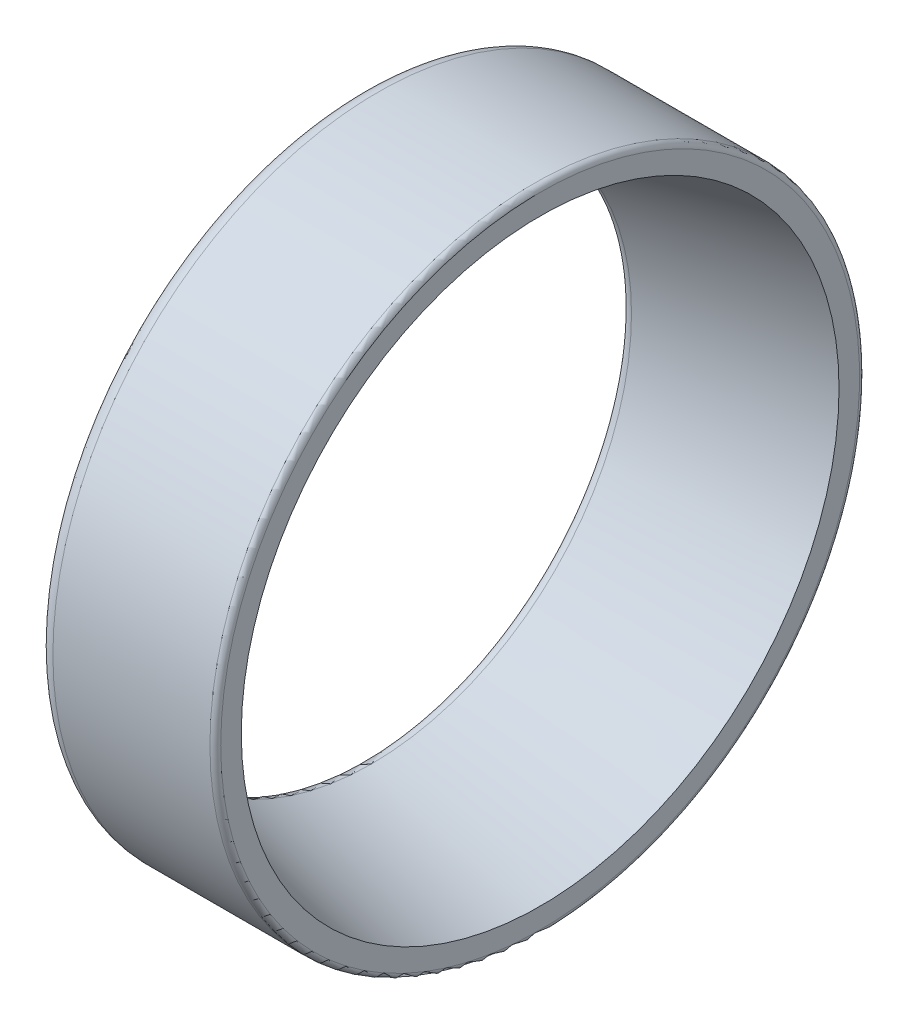
ISO-10303-21;
HEADER;
FILE_DESCRIPTION(('STEP AP214'),'2;1');
FILE_NAME('part.step','',(''),(''),'','','');
FILE_SCHEMA(('AUTOMOTIVE_DESIGN { 1 0 10303 214 1 1 1 1 }'));
ENDSEC;
DATA;
#1=APPLICATION_CONTEXT('core data for automotive mechanical design processes');
#2=APPLICATION_PROTOCOL_DEFINITION('international standard','automotive_design',2000,#1);
#3=PRODUCT_CONTEXT('',#1,'mechanical');
#4=PRODUCT('Part','Part','',(#3));
#5=PRODUCT_RELATED_PRODUCT_CATEGORY('part','',(#4));
#6=PRODUCT_DEFINITION_FORMATION('','',#4);
#7=PRODUCT_DEFINITION_CONTEXT('part definition',#1,'design');
#8=PRODUCT_DEFINITION('design','',#6,#7);
#9=PRODUCT_DEFINITION_SHAPE('','',#8);
#10=(LENGTH_UNIT() NAMED_UNIT(*) SI_UNIT(.MILLI.,.METRE.));
#11=(NAMED_UNIT(*) PLANE_ANGLE_UNIT() SI_UNIT($,.RADIAN.));
#12=(NAMED_UNIT(*) SI_UNIT($,.STERADIAN.) SOLID_ANGLE_UNIT());
#13=UNCERTAINTY_MEASURE_WITH_UNIT(LENGTH_MEASURE(1.E-05),#10,'distance_accuracy_value','');
#14=(GEOMETRIC_REPRESENTATION_CONTEXT(3) GLOBAL_UNCERTAINTY_ASSIGNED_CONTEXT((#13)) GLOBAL_UNIT_ASSIGNED_CONTEXT((#10,
#11,#12)) REPRESENTATION_CONTEXT('',''));
#15=CARTESIAN_POINT('',(0.,0.,0.));
#16=DIRECTION('',(0.,0.,1.));
#17=DIRECTION('',(1.,0.,0.));
#18=AXIS2_PLACEMENT_3D('',#15,#16,#17);
#19=CARTESIAN_POINT('',(0.,-19.3529505311129,-19.));
#20=DIRECTION('',(-1.,0.,0.));
#21=DIRECTION('',(0.,0.,1.));
#22=AXIS2_PLACEMENT_3D('',#19,#20,#21);
#23=PLANE('',#22);
#24=CARTESIAN_POINT('',(0.,0.,0.));
#25=DIRECTION('',(-1.,0.,0.));
#26=DIRECTION('',(0.,0.,-1.));
#27=AXIS2_PLACEMENT_3D('',#24,#25,#26);
#28=CIRCLE('',#27,19.);
#29=CARTESIAN_POINT('',(0.,0.,-19.));
#30=VERTEX_POINT('',#29);
#31=EDGE_CURVE('E41',#30,#30,#28,.F.);
#32=ORIENTED_EDGE('',*,*,#31,.F.);
#33=EDGE_LOOP('',(#32));
#34=FACE_BOUND('',#33,.T.);
#35=CARTESIAN_POINT('',(0.,0.,0.));
#36=DIRECTION('',(1.,0.,0.));
#37=DIRECTION('',(0.,-1.16844557777101E-09,1.));
#38=AXIS2_PLACEMENT_3D('',#35,#36,#37);
#39=CIRCLE('',#38,16.499640715141);
#40=CARTESIAN_POINT('',(0.,-1.9278932228417E-08,16.499640715141));
#41=VERTEX_POINT('',#40);
#42=EDGE_CURVE('E38',#41,#41,#39,.T.);
#43=ORIENTED_EDGE('',*,*,#42,.T.);
#44=EDGE_LOOP('',(#43));
#45=FACE_BOUND('',#44,.T.);
#46=ADVANCED_FACE('F15',(#34,#45),#23,.T.);
#47=CARTESIAN_POINT('',(11.,-20.0320014269418,19.666666666667));
#48=DIRECTION('',(1.,0.,0.));
#49=DIRECTION('',(0.,0.,-1.));
#50=AXIS2_PLACEMENT_3D('',#47,#48,#49);
#51=PLANE('',#50);
#52=CARTESIAN_POINT('',(11.,0.,0.));
#53=DIRECTION('',(1.,0.,0.));
#54=DIRECTION('',(0.,0.,1.));
#55=AXIS2_PLACEMENT_3D('',#52,#53,#54);
#56=CIRCLE('',#55,19.666666666667);
#57=CARTESIAN_POINT('',(11.,0.,19.666666666667));
#58=VERTEX_POINT('',#57);
#59=EDGE_CURVE('E35',#58,#58,#56,.T.);
#60=ORIENTED_EDGE('',*,*,#59,.T.);
#61=EDGE_LOOP('',(#60));
#62=FACE_BOUND('',#61,.T.);
#63=CARTESIAN_POINT('',(11.,0.,0.));
#64=DIRECTION('',(-1.,0.,0.));
#65=DIRECTION('',(0.,0.,-1.));
#66=AXIS2_PLACEMENT_3D('',#63,#64,#65);
#67=CIRCLE('',#66,18.40163109028);
#68=CARTESIAN_POINT('',(11.,0.,-18.40163109028));
#69=VERTEX_POINT('',#68);
#70=EDGE_CURVE('E30',#69,#69,#67,.F.);
#71=ORIENTED_EDGE('',*,*,#70,.F.);
#72=EDGE_LOOP('',(#71));
#73=FACE_BOUND('',#72,.T.);
#74=ADVANCED_FACE('F49',(#62,#73),#51,.T.);
#75=CARTESIAN_POINT('',(0.499999999998968,0.,0.));
#76=DIRECTION('',(1.,0.,0.));
#77=DIRECTION('',(0.,8.59112171437013E-09,1.));
#78=AXIS2_PLACEMENT_3D('',#75,#76,#77);
#79=TOROIDAL_SURFACE('',#78,16.4996407151407,0.499999999998968);
#80=ORIENTED_EDGE('',*,*,#42,.F.);
#81=EDGE_LOOP('',(#80));
#82=FACE_BOUND('',#81,.T.);
#83=CARTESIAN_POINT('',(0.612075849178925,0.,0.));
#84=DIRECTION('',(1.,0.,0.));
#85=DIRECTION('',(0.,0.,1.));
#86=AXIS2_PLACEMENT_3D('',#83,#84,#85);
#87=CIRCLE('',#86,16.012363582464);
#88=CARTESIAN_POINT('',(0.612075849178925,0.,16.012363582464));
#89=VERTEX_POINT('',#88);
#90=EDGE_CURVE('E26',#89,#89,#87,.T.);
#91=ORIENTED_EDGE('',*,*,#90,.T.);
#92=EDGE_LOOP('',(#91));
#93=FACE_BOUND('',#92,.T.);
#94=ADVANCED_FACE('F53',(#82,#93),#79,.T.);
#95=CARTESIAN_POINT('',(11.,0.,0.));
#96=DIRECTION('',(1.,0.,0.));
#97=DIRECTION('',(0.,1.16844768339328E-09,1.));
#98=AXIS2_PLACEMENT_3D('',#95,#96,#97);
#99=CONICAL_SURFACE('',#98,18.40163109028,0.226072498010736);
#100=ORIENTED_EDGE('',*,*,#70,.T.);
#101=EDGE_LOOP('',(#100));
#102=FACE_BOUND('',#101,.T.);
#103=ORIENTED_EDGE('',*,*,#90,.F.);
#104=EDGE_LOOP('',(#103));
#105=FACE_BOUND('',#104,.T.);
#106=ADVANCED_FACE('F56',(#102,#105),#99,.F.);
#107=CARTESIAN_POINT('',(10.666666666666,0.,0.));
#108=DIRECTION('',(1.,0.,0.));
#109=DIRECTION('',(0.,0.,1.));
#110=AXIS2_PLACEMENT_3D('',#107,#108,#109);
#111=TOROIDAL_SURFACE('',#110,19.6666666666661,0.333333333333957);
#112=CARTESIAN_POINT('',(10.666666666666,0.,0.));
#113=DIRECTION('',(1.,0.,0.));
#114=DIRECTION('',(0.,0.,1.));
#115=AXIS2_PLACEMENT_3D('',#112,#113,#114);
#116=CIRCLE('',#115,20.);
#117=CARTESIAN_POINT('',(10.666666666666,0.,20.));
#118=VERTEX_POINT('',#117);
#119=EDGE_CURVE('E22',#118,#118,#116,.T.);
#120=ORIENTED_EDGE('',*,*,#119,.T.);
#121=EDGE_LOOP('',(#120));
#122=FACE_BOUND('',#121,.T.);
#123=ORIENTED_EDGE('',*,*,#59,.F.);
#124=EDGE_LOOP('',(#123));
#125=FACE_BOUND('',#124,.T.);
#126=ADVANCED_FACE('F61',(#122,#125),#111,.T.);
#127=CARTESIAN_POINT('',(11.,0.,0.));
#128=DIRECTION('',(1.,0.,0.));
#129=DIRECTION('',(0.,0.,1.));
#130=AXIS2_PLACEMENT_3D('',#127,#128,#129);
#131=CYLINDRICAL_SURFACE('',#130,20.);
#132=CARTESIAN_POINT('',(1.,0.,0.));
#133=DIRECTION('',(1.,0.,0.));
#134=DIRECTION('',(0.,0.,1.));
#135=AXIS2_PLACEMENT_3D('',#132,#133,#134);
#136=CIRCLE('',#135,20.);
#137=CARTESIAN_POINT('',(1.,0.,20.));
#138=VERTEX_POINT('',#137);
#139=EDGE_CURVE('E10',#138,#138,#136,.T.);
#140=ORIENTED_EDGE('',*,*,#139,.T.);
#141=EDGE_LOOP('',(#140));
#142=FACE_BOUND('',#141,.T.);
#143=ORIENTED_EDGE('',*,*,#119,.F.);
#144=EDGE_LOOP('',(#143));
#145=FACE_BOUND('',#144,.T.);
#146=ADVANCED_FACE('F68',(#142,#145),#131,.T.);
#147=CARTESIAN_POINT('',(0.99999999999922,0.,0.));
#148=DIRECTION('',(1.,0.,0.));
#149=DIRECTION('',(0.,0.,1.));
#150=AXIS2_PLACEMENT_3D('',#147,#148,#149);
#151=TOROIDAL_SURFACE('',#150,19.0000000000008,0.99999999999922);
#152=ORIENTED_EDGE('',*,*,#31,.T.);
#153=EDGE_LOOP('',(#152));
#154=FACE_BOUND('',#153,.T.);
#155=ORIENTED_EDGE('',*,*,#139,.F.);
#156=EDGE_LOOP('',(#155));
#157=FACE_BOUND('',#156,.T.);
#158=ADVANCED_FACE('F17',(#154,#157),#151,.T.);
#159=CLOSED_SHELL('',(#46,#74,#94,#106,#126,#146,#158));
#160=MANIFOLD_SOLID_BREP('B1',#159);
#161=ADVANCED_BREP_SHAPE_REPRESENTATION('',(#18,#160),#14);
#162=SHAPE_DEFINITION_REPRESENTATION(#9,#161);
ENDSEC;
END-ISO-10303-21;
